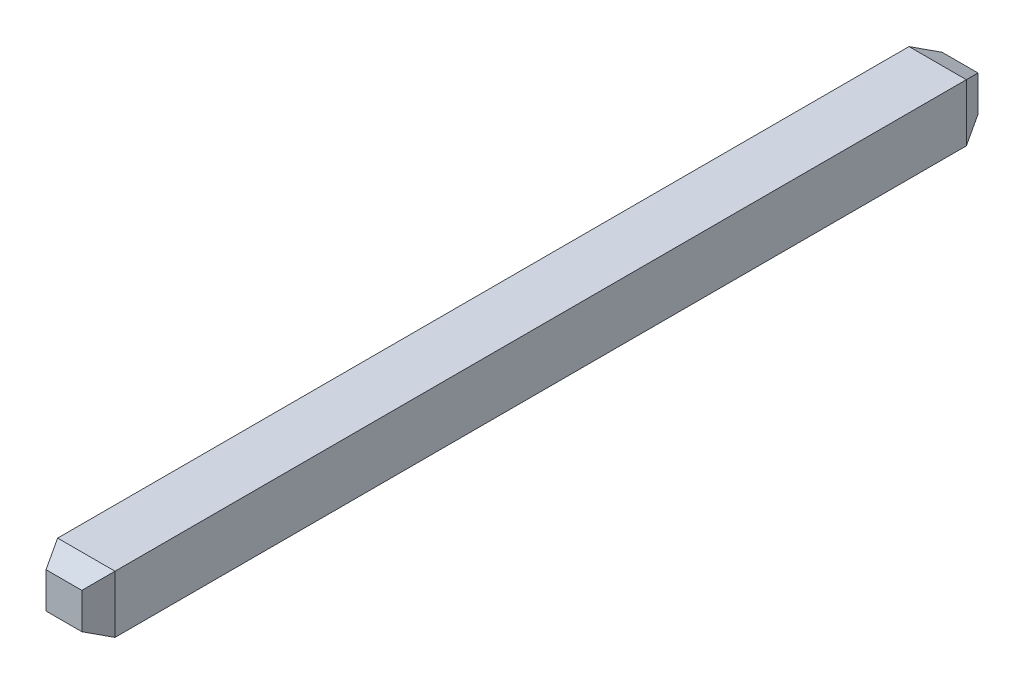
ISO-10303-21;
HEADER;
FILE_DESCRIPTION(('STEP AP214'),'2;1');
FILE_NAME('part.step','',(''),(''),'','','');
FILE_SCHEMA(('AUTOMOTIVE_DESIGN { 1 0 10303 214 1 1 1 1 }'));
ENDSEC;
DATA;
#1=APPLICATION_CONTEXT('core data for automotive mechanical design processes');
#2=APPLICATION_PROTOCOL_DEFINITION('international standard','automotive_design',2000,#1);
#3=PRODUCT_CONTEXT('',#1,'mechanical');
#4=PRODUCT('Part','Part','',(#3));
#5=PRODUCT_RELATED_PRODUCT_CATEGORY('part','',(#4));
#6=PRODUCT_DEFINITION_FORMATION('','',#4);
#7=PRODUCT_DEFINITION_CONTEXT('part definition',#1,'design');
#8=PRODUCT_DEFINITION('design','',#6,#7);
#9=PRODUCT_DEFINITION_SHAPE('','',#8);
#10=(LENGTH_UNIT() NAMED_UNIT(*) SI_UNIT(.MILLI.,.METRE.));
#11=(NAMED_UNIT(*) PLANE_ANGLE_UNIT() SI_UNIT($,.RADIAN.));
#12=(NAMED_UNIT(*) SI_UNIT($,.STERADIAN.) SOLID_ANGLE_UNIT());
#13=UNCERTAINTY_MEASURE_WITH_UNIT(LENGTH_MEASURE(1.E-05),#10,'distance_accuracy_value','');
#14=(GEOMETRIC_REPRESENTATION_CONTEXT(3) GLOBAL_UNCERTAINTY_ASSIGNED_CONTEXT((#13)) GLOBAL_UNIT_ASSIGNED_CONTEXT((#10,
#11,#12)) REPRESENTATION_CONTEXT('',''));
#15=CARTESIAN_POINT('',(0.,0.,0.));
#16=DIRECTION('',(0.,0.,1.));
#17=DIRECTION('',(1.,0.,0.));
#18=AXIS2_PLACEMENT_3D('',#15,#16,#17);
#19=CARTESIAN_POINT('',(0.16,0.32,2.5));
#20=DIRECTION('',(0.,1.,0.));
#21=DIRECTION('',(1.,0.,0.));
#22=AXIS2_PLACEMENT_3D('',#19,#20,#21);
#23=PLANE('',#22);
#24=DIRECTION('',(1.,0.,0.));
#25=VECTOR('',#24,1.);
#26=CARTESIAN_POINT('',(-0.08,0.32,4.75));
#27=LINE('',#26,#25);
#28=CARTESIAN_POINT('',(-0.32,0.32,4.75));
#29=VERTEX_POINT('',#28);
#30=CARTESIAN_POINT('',(0.32,0.32,4.75));
#31=VERTEX_POINT('',#30);
#32=EDGE_CURVE('E198',#29,#31,#27,.T.);
#33=ORIENTED_EDGE('',*,*,#32,.T.);
#34=DIRECTION('',(0.,0.,-1.));
#35=VECTOR('',#34,1.);
#36=CARTESIAN_POINT('',(0.32,0.32,0.));
#37=LINE('',#36,#35);
#38=CARTESIAN_POINT('',(0.32,0.32,-4.75));
#39=VERTEX_POINT('',#38);
#40=EDGE_CURVE('E20',#31,#39,#37,.T.);
#41=ORIENTED_EDGE('',*,*,#40,.T.);
#42=DIRECTION('',(1.,0.,0.));
#43=VECTOR('',#42,1.);
#44=CARTESIAN_POINT('',(-0.08,0.32,-4.75));
#45=LINE('',#44,#43);
#46=CARTESIAN_POINT('',(-0.32,0.32,-4.75));
#47=VERTEX_POINT('',#46);
#48=EDGE_CURVE('E159',#47,#39,#45,.T.);
#49=ORIENTED_EDGE('',*,*,#48,.F.);
#50=DIRECTION('',(0.,0.,-1.));
#51=VECTOR('',#50,1.);
#52=CARTESIAN_POINT('',(-0.32,0.32,0.));
#53=LINE('',#52,#51);
#54=EDGE_CURVE('E189',#29,#47,#53,.T.);
#55=ORIENTED_EDGE('',*,*,#54,.F.);
#56=EDGE_LOOP('',(#33,#41,#49,#55));
#57=FACE_BOUND('',#56,.T.);
#58=ADVANCED_FACE('F17',(#57),#23,.T.);
#59=CARTESIAN_POINT('',(0.2,0.,5.));
#60=DIRECTION('',(0.901523057468274,0.,0.432731067584771));
#61=DIRECTION('',(0.,-1.,0.));
#62=AXIS2_PLACEMENT_3D('',#59,#60,#61);
#63=PLANE('',#62);
#64=DIRECTION('',(0.397142035392897,0.397142035392897,-0.827379240401869));
#65=VECTOR('',#64,1.);
#66=CARTESIAN_POINT('',(0.218992332968237,0.218992332968237,4.96043263964951));
#67=LINE('',#66,#65);
#68=CARTESIAN_POINT('',(0.2,0.2,5.));
#69=VERTEX_POINT('',#68);
#70=EDGE_CURVE('E185',#69,#31,#67,.T.);
#71=ORIENTED_EDGE('',*,*,#70,.F.);
#72=DIRECTION('',(0.,1.,0.));
#73=VECTOR('',#72,1.);
#74=CARTESIAN_POINT('',(0.2,0.,5.));
#75=LINE('',#74,#73);
#76=CARTESIAN_POINT('',(0.2,-0.2,5.));
#77=VERTEX_POINT('',#76);
#78=EDGE_CURVE('E205',#77,#69,#75,.T.);
#79=ORIENTED_EDGE('',*,*,#78,.F.);
#80=DIRECTION('',(0.397142035392897,-0.397142035392897,-0.827379240401869));
#81=VECTOR('',#80,1.);
#82=CARTESIAN_POINT('',(0.218992332968237,-0.218992332968237,4.96043263964951));
#83=LINE('',#82,#81);
#84=CARTESIAN_POINT('',(0.32,-0.32,4.75));
#85=VERTEX_POINT('',#84);
#86=EDGE_CURVE('E162',#77,#85,#83,.T.);
#87=ORIENTED_EDGE('',*,*,#86,.T.);
#88=DIRECTION('',(0.,1.,0.));
#89=VECTOR('',#88,1.);
#90=CARTESIAN_POINT('',(0.32,0.,4.75));
#91=LINE('',#90,#89);
#92=EDGE_CURVE('E11',#85,#31,#91,.T.);
#93=ORIENTED_EDGE('',*,*,#92,.T.);
#94=EDGE_LOOP('',(#71,#79,#87,#93));
#95=FACE_BOUND('',#94,.T.);
#96=ADVANCED_FACE('F246',(#95),#63,.T.);
#97=CARTESIAN_POINT('',(0.32,0.,4.75));
#98=DIRECTION('',(1.,0.,0.));
#99=DIRECTION('',(0.,1.,0.));
#100=AXIS2_PLACEMENT_3D('',#97,#98,#99);
#101=PLANE('',#100);
#102=ORIENTED_EDGE('',*,*,#40,.F.);
#103=ORIENTED_EDGE('',*,*,#92,.F.);
#104=DIRECTION('',(0.,0.,-1.));
#105=VECTOR('',#104,1.);
#106=CARTESIAN_POINT('',(0.32,-0.32,0.));
#107=LINE('',#106,#105);
#108=CARTESIAN_POINT('',(0.32,-0.32,-4.75));
#109=VERTEX_POINT('',#108);
#110=EDGE_CURVE('E180',#85,#109,#107,.T.);
#111=ORIENTED_EDGE('',*,*,#110,.T.);
#112=DIRECTION('',(0.,1.,0.));
#113=VECTOR('',#112,1.);
#114=CARTESIAN_POINT('',(0.32,0.,-4.75));
#115=LINE('',#114,#113);
#116=EDGE_CURVE('E169',#109,#39,#115,.T.);
#117=ORIENTED_EDGE('',*,*,#116,.T.);
#118=EDGE_LOOP('',(#102,#103,#111,#117));
#119=FACE_BOUND('',#118,.T.);
#120=ADVANCED_FACE('F217',(#119),#101,.T.);
#121=CARTESIAN_POINT('',(0.,0.,5.));
#122=DIRECTION('',(0.,0.,1.));
#123=DIRECTION('',(1.,0.,0.));
#124=AXIS2_PLACEMENT_3D('',#121,#122,#123);
#125=PLANE('',#124);
#126=DIRECTION('',(1.,0.,0.));
#127=VECTOR('',#126,1.);
#128=CARTESIAN_POINT('',(0.,0.2,5.));
#129=LINE('',#128,#127);
#130=CARTESIAN_POINT('',(-0.2,0.2,5.));
#131=VERTEX_POINT('',#130);
#132=EDGE_CURVE('E202',#131,#69,#129,.T.);
#133=ORIENTED_EDGE('',*,*,#132,.F.);
#134=DIRECTION('',(0.,-1.,0.));
#135=VECTOR('',#134,1.);
#136=CARTESIAN_POINT('',(-0.2,0.,5.));
#137=LINE('',#136,#135);
#138=CARTESIAN_POINT('',(-0.2,-0.2,5.));
#139=VERTEX_POINT('',#138);
#140=EDGE_CURVE('E83',#131,#139,#137,.T.);
#141=ORIENTED_EDGE('',*,*,#140,.T.);
#142=DIRECTION('',(1.,0.,0.));
#143=VECTOR('',#142,1.);
#144=CARTESIAN_POINT('',(0.,-0.2,5.));
#145=LINE('',#144,#143);
#146=EDGE_CURVE('E160',#139,#77,#145,.T.);
#147=ORIENTED_EDGE('',*,*,#146,.T.);
#148=ORIENTED_EDGE('',*,*,#78,.T.);
#149=EDGE_LOOP('',(#133,#141,#147,#148));
#150=FACE_BOUND('',#149,.T.);
#151=ADVANCED_FACE('F247',(#150),#125,.T.);
#152=CARTESIAN_POINT('',(0.,0.32,4.75));
#153=DIRECTION('',(0.,0.901523057468274,0.432731067584771));
#154=DIRECTION('',(1.,0.,0.));
#155=AXIS2_PLACEMENT_3D('',#152,#153,#154);
#156=PLANE('',#155);
#157=ORIENTED_EDGE('',*,*,#70,.T.);
#158=ORIENTED_EDGE('',*,*,#32,.F.);
#159=DIRECTION('',(-0.397142035392897,0.397142035392897,-0.827379240401869));
#160=VECTOR('',#159,1.);
#161=CARTESIAN_POINT('',(-0.218992332968237,0.218992332968237,4.96043263964951));
#162=LINE('',#161,#160);
#163=EDGE_CURVE('E186',#131,#29,#162,.T.);
#164=ORIENTED_EDGE('',*,*,#163,.F.);
#165=ORIENTED_EDGE('',*,*,#132,.T.);
#166=EDGE_LOOP('',(#157,#158,#164,#165));
#167=FACE_BOUND('',#166,.T.);
#168=ADVANCED_FACE('F245',(#167),#156,.T.);
#169=CARTESIAN_POINT('',(-0.2,0.,5.));
#170=DIRECTION('',(0.901523057468274,0.,-0.432731067584771));
#171=DIRECTION('',(0.,-1.,0.));
#172=AXIS2_PLACEMENT_3D('',#169,#170,#171);
#173=PLANE('',#172);
#174=ORIENTED_EDGE('',*,*,#163,.T.);
#175=DIRECTION('',(0.,1.,0.));
#176=VECTOR('',#175,1.);
#177=CARTESIAN_POINT('',(-0.32,0.,4.75));
#178=LINE('',#177,#176);
#179=CARTESIAN_POINT('',(-0.32,-0.32,4.75));
#180=VERTEX_POINT('',#179);
#181=EDGE_CURVE('E71',#180,#29,#178,.T.);
#182=ORIENTED_EDGE('',*,*,#181,.F.);
#183=DIRECTION('',(-0.397142035392897,-0.397142035392897,-0.827379240401869));
#184=VECTOR('',#183,1.);
#185=CARTESIAN_POINT('',(-0.218992332968237,-0.218992332968237,4.96043263964951));
#186=LINE('',#185,#184);
#187=EDGE_CURVE('E156',#139,#180,#186,.T.);
#188=ORIENTED_EDGE('',*,*,#187,.F.);
#189=ORIENTED_EDGE('',*,*,#140,.F.);
#190=EDGE_LOOP('',(#174,#182,#188,#189));
#191=FACE_BOUND('',#190,.T.);
#192=ADVANCED_FACE('F242',(#191),#173,.F.);
#193=CARTESIAN_POINT('',(-0.32,0.,4.75));
#194=DIRECTION('',(1.,0.,0.));
#195=DIRECTION('',(0.,0.,-1.));
#196=AXIS2_PLACEMENT_3D('',#193,#194,#195);
#197=PLANE('',#196);
#198=ORIENTED_EDGE('',*,*,#181,.T.);
#199=ORIENTED_EDGE('',*,*,#54,.T.);
#200=DIRECTION('',(0.,1.,0.));
#201=VECTOR('',#200,1.);
#202=CARTESIAN_POINT('',(-0.32,0.,-4.75));
#203=LINE('',#202,#201);
#204=CARTESIAN_POINT('',(-0.32,-0.32,-4.75));
#205=VERTEX_POINT('',#204);
#206=EDGE_CURVE('E120',#205,#47,#203,.T.);
#207=ORIENTED_EDGE('',*,*,#206,.F.);
#208=DIRECTION('',(0.,0.,1.));
#209=VECTOR('',#208,1.);
#210=CARTESIAN_POINT('',(-0.32,-0.32,0.));
#211=LINE('',#210,#209);
#212=EDGE_CURVE('E155',#205,#180,#211,.T.);
#213=ORIENTED_EDGE('',*,*,#212,.T.);
#214=EDGE_LOOP('',(#198,#199,#207,#213));
#215=FACE_BOUND('',#214,.T.);
#216=ADVANCED_FACE('F234',(#215),#197,.F.);
#217=CARTESIAN_POINT('',(0.16,-0.32,2.5));
#218=DIRECTION('',(0.,1.,0.));
#219=DIRECTION('',(1.,0.,0.));
#220=AXIS2_PLACEMENT_3D('',#217,#218,#219);
#221=PLANE('',#220);
#222=DIRECTION('',(1.,0.,0.));
#223=VECTOR('',#222,1.);
#224=CARTESIAN_POINT('',(-0.08,-0.32,4.75));
#225=LINE('',#224,#223);
#226=EDGE_CURVE('E151',#180,#85,#225,.T.);
#227=ORIENTED_EDGE('',*,*,#226,.F.);
#228=ORIENTED_EDGE('',*,*,#212,.F.);
#229=DIRECTION('',(1.,0.,0.));
#230=VECTOR('',#229,1.);
#231=CARTESIAN_POINT('',(-0.08,-0.32,-4.75));
#232=LINE('',#231,#230);
#233=EDGE_CURVE('E134',#205,#109,#232,.T.);
#234=ORIENTED_EDGE('',*,*,#233,.T.);
#235=ORIENTED_EDGE('',*,*,#110,.F.);
#236=EDGE_LOOP('',(#227,#228,#234,#235));
#237=FACE_BOUND('',#236,.T.);
#238=ADVANCED_FACE('F237',(#237),#221,.F.);
#239=CARTESIAN_POINT('',(0.,-0.32,4.75));
#240=DIRECTION('',(0.,0.901523057468274,-0.432731067584771));
#241=DIRECTION('',(-1.,0.,0.));
#242=AXIS2_PLACEMENT_3D('',#239,#240,#241);
#243=PLANE('',#242);
#244=ORIENTED_EDGE('',*,*,#86,.F.);
#245=ORIENTED_EDGE('',*,*,#146,.F.);
#246=ORIENTED_EDGE('',*,*,#187,.T.);
#247=ORIENTED_EDGE('',*,*,#226,.T.);
#248=EDGE_LOOP('',(#244,#245,#246,#247));
#249=FACE_BOUND('',#248,.T.);
#250=ADVANCED_FACE('F241',(#249),#243,.F.);
#251=CARTESIAN_POINT('',(0.2,0.,-5.));
#252=DIRECTION('',(-0.901523057468274,0.,0.432731067584771));
#253=DIRECTION('',(0.,1.,0.));
#254=AXIS2_PLACEMENT_3D('',#251,#252,#253);
#255=PLANE('',#254);
#256=DIRECTION('',(0.397142035392897,0.397142035392897,0.827379240401869));
#257=VECTOR('',#256,1.);
#258=CARTESIAN_POINT('',(0.218992332968237,0.218992332968237,-4.96043263964951));
#259=LINE('',#258,#257);
#260=CARTESIAN_POINT('',(0.2,0.2,-5.));
#261=VERTEX_POINT('',#260);
#262=EDGE_CURVE('E146',#261,#39,#259,.T.);
#263=ORIENTED_EDGE('',*,*,#262,.T.);
#264=ORIENTED_EDGE('',*,*,#116,.F.);
#265=DIRECTION('',(0.397142035392897,-0.397142035392897,0.827379240401869));
#266=VECTOR('',#265,1.);
#267=CARTESIAN_POINT('',(0.218992332968237,-0.218992332968237,-4.96043263964951));
#268=LINE('',#267,#266);
#269=CARTESIAN_POINT('',(0.2,-0.2,-5.));
#270=VERTEX_POINT('',#269);
#271=EDGE_CURVE('E141',#270,#109,#268,.T.);
#272=ORIENTED_EDGE('',*,*,#271,.F.);
#273=DIRECTION('',(0.,1.,0.));
#274=VECTOR('',#273,1.);
#275=CARTESIAN_POINT('',(0.2,0.,-5.));
#276=LINE('',#275,#274);
#277=EDGE_CURVE('E126',#270,#261,#276,.T.);
#278=ORIENTED_EDGE('',*,*,#277,.T.);
#279=EDGE_LOOP('',(#263,#264,#272,#278));
#280=FACE_BOUND('',#279,.T.);
#281=ADVANCED_FACE('F223',(#280),#255,.F.);
#282=CARTESIAN_POINT('',(0.,0.,-5.));
#283=DIRECTION('',(0.,0.,1.));
#284=DIRECTION('',(1.,0.,0.));
#285=AXIS2_PLACEMENT_3D('',#282,#283,#284);
#286=PLANE('',#285);
#287=DIRECTION('',(1.,0.,0.));
#288=VECTOR('',#287,1.);
#289=CARTESIAN_POINT('',(0.,0.2,-5.));
#290=LINE('',#289,#288);
#291=CARTESIAN_POINT('',(-0.2,0.2,-5.));
#292=VERTEX_POINT('',#291);
#293=EDGE_CURVE('E150',#292,#261,#290,.T.);
#294=ORIENTED_EDGE('',*,*,#293,.T.);
#295=ORIENTED_EDGE('',*,*,#277,.F.);
#296=DIRECTION('',(1.,0.,0.));
#297=VECTOR('',#296,1.);
#298=CARTESIAN_POINT('',(0.,-0.2,-5.));
#299=LINE('',#298,#297);
#300=CARTESIAN_POINT('',(-0.2,-0.2,-5.));
#301=VERTEX_POINT('',#300);
#302=EDGE_CURVE('E124',#301,#270,#299,.T.);
#303=ORIENTED_EDGE('',*,*,#302,.F.);
#304=DIRECTION('',(0.,-1.,0.));
#305=VECTOR('',#304,1.);
#306=CARTESIAN_POINT('',(-0.2,0.,-5.));
#307=LINE('',#306,#305);
#308=EDGE_CURVE('E108',#292,#301,#307,.T.);
#309=ORIENTED_EDGE('',*,*,#308,.F.);
#310=EDGE_LOOP('',(#294,#295,#303,#309));
#311=FACE_BOUND('',#310,.T.);
#312=ADVANCED_FACE('F125',(#311),#286,.F.);
#313=CARTESIAN_POINT('',(0.,0.32,-4.75));
#314=DIRECTION('',(0.,-0.901523057468274,0.432731067584771));
#315=DIRECTION('',(-1.,0.,0.));
#316=AXIS2_PLACEMENT_3D('',#313,#314,#315);
#317=PLANE('',#316);
#318=ORIENTED_EDGE('',*,*,#262,.F.);
#319=ORIENTED_EDGE('',*,*,#293,.F.);
#320=DIRECTION('',(-0.397142035392897,0.397142035392897,0.827379240401869));
#321=VECTOR('',#320,1.);
#322=CARTESIAN_POINT('',(-0.218992332968236,0.218992332968237,-4.96043263964951));
#323=LINE('',#322,#321);
#324=EDGE_CURVE('E116',#292,#47,#323,.T.);
#325=ORIENTED_EDGE('',*,*,#324,.T.);
#326=ORIENTED_EDGE('',*,*,#48,.T.);
#327=EDGE_LOOP('',(#318,#319,#325,#326));
#328=FACE_BOUND('',#327,.T.);
#329=ADVANCED_FACE('F222',(#328),#317,.F.);
#330=CARTESIAN_POINT('',(-0.2,0.,-5.));
#331=DIRECTION('',(-0.901523057468274,0.,-0.432731067584771));
#332=DIRECTION('',(-0.432731067584771,0.,0.901523057468274));
#333=AXIS2_PLACEMENT_3D('',#330,#331,#332);
#334=PLANE('',#333);
#335=ORIENTED_EDGE('',*,*,#324,.F.);
#336=ORIENTED_EDGE('',*,*,#308,.T.);
#337=DIRECTION('',(-0.397142035392897,-0.397142035392897,0.827379240401869));
#338=VECTOR('',#337,1.);
#339=CARTESIAN_POINT('',(-0.218992332968236,-0.218992332968237,-4.96043263964951));
#340=LINE('',#339,#338);
#341=EDGE_CURVE('E113',#301,#205,#340,.T.);
#342=ORIENTED_EDGE('',*,*,#341,.T.);
#343=ORIENTED_EDGE('',*,*,#206,.T.);
#344=EDGE_LOOP('',(#335,#336,#342,#343));
#345=FACE_BOUND('',#344,.T.);
#346=ADVANCED_FACE('F110',(#345),#334,.T.);
#347=CARTESIAN_POINT('',(0.,-0.32,-4.75));
#348=DIRECTION('',(0.,-0.901523057468274,-0.432731067584771));
#349=DIRECTION('',(0.,0.432731067584771,-0.901523057468274));
#350=AXIS2_PLACEMENT_3D('',#347,#348,#349);
#351=PLANE('',#350);
#352=ORIENTED_EDGE('',*,*,#271,.T.);
#353=ORIENTED_EDGE('',*,*,#233,.F.);
#354=ORIENTED_EDGE('',*,*,#341,.F.);
#355=ORIENTED_EDGE('',*,*,#302,.T.);
#356=EDGE_LOOP('',(#352,#353,#354,#355));
#357=FACE_BOUND('',#356,.T.);
#358=ADVANCED_FACE('F132',(#357),#351,.T.);
#359=CLOSED_SHELL('',(#58,#96,#120,#151,#168,#192,#216,#238,#250,#281,#312,#329,#346,#358));
#360=MANIFOLD_SOLID_BREP('B1',#359);
#361=ADVANCED_BREP_SHAPE_REPRESENTATION('',(#18,#360),#14);
#362=SHAPE_DEFINITION_REPRESENTATION(#9,#361);
ENDSEC;
END-ISO-10303-21;
